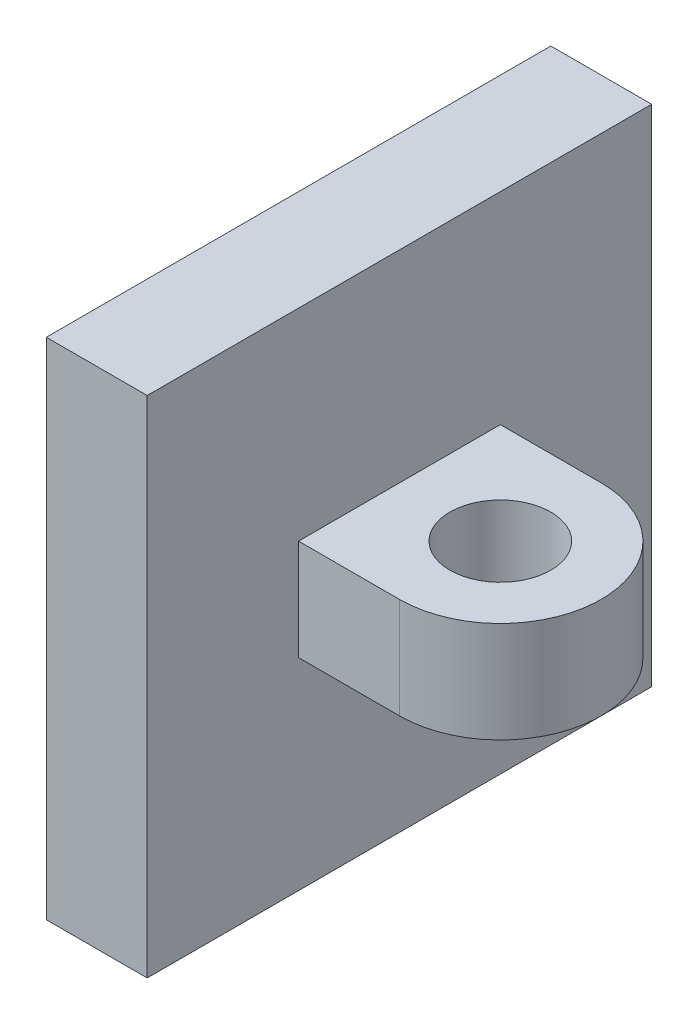
ISO-10303-21;
HEADER;
FILE_DESCRIPTION(('STEP AP214'),'2;1');
FILE_NAME('part.step','',(''),(''),'','','');
FILE_SCHEMA(('AUTOMOTIVE_DESIGN { 1 0 10303 214 1 1 1 1 }'));
ENDSEC;
DATA;
#1=APPLICATION_CONTEXT('core data for automotive mechanical design processes');
#2=APPLICATION_PROTOCOL_DEFINITION('international standard','automotive_design',2000,#1);
#3=PRODUCT_CONTEXT('',#1,'mechanical');
#4=PRODUCT('Part','Part','',(#3));
#5=PRODUCT_RELATED_PRODUCT_CATEGORY('part','',(#4));
#6=PRODUCT_DEFINITION_FORMATION('','',#4);
#7=PRODUCT_DEFINITION_CONTEXT('part definition',#1,'design');
#8=PRODUCT_DEFINITION('design','',#6,#7);
#9=PRODUCT_DEFINITION_SHAPE('','',#8);
#10=(LENGTH_UNIT() NAMED_UNIT(*) SI_UNIT(.MILLI.,.METRE.));
#11=(NAMED_UNIT(*) PLANE_ANGLE_UNIT() SI_UNIT($,.RADIAN.));
#12=(NAMED_UNIT(*) SI_UNIT($,.STERADIAN.) SOLID_ANGLE_UNIT());
#13=UNCERTAINTY_MEASURE_WITH_UNIT(LENGTH_MEASURE(1.E-05),#10,'distance_accuracy_value','');
#14=(GEOMETRIC_REPRESENTATION_CONTEXT(3) GLOBAL_UNCERTAINTY_ASSIGNED_CONTEXT((#13)) GLOBAL_UNIT_ASSIGNED_CONTEXT((#10,
#11,#12)) REPRESENTATION_CONTEXT('',''));
#15=CARTESIAN_POINT('',(0.,0.,0.));
#16=DIRECTION('',(0.,0.,1.));
#17=DIRECTION('',(1.,0.,0.));
#18=AXIS2_PLACEMENT_3D('',#15,#16,#17);
#19=CARTESIAN_POINT('',(-0.770114942528737,10.,-1.62068965517241));
#20=DIRECTION('',(1.,0.,0.));
#21=DIRECTION('',(0.,0.,-1.));
#22=AXIS2_PLACEMENT_3D('',#19,#20,#21);
#23=PLANE('',#22);
#24=DIRECTION('',(0.,0.,1.));
#25=VECTOR('',#24,1.);
#26=CARTESIAN_POINT('',(-0.770114942528737,0.,-1.62068965517241));
#27=LINE('',#26,#25);
#28=CARTESIAN_POINT('',(-0.770114942528737,0.,-1.62068965517241));
#29=VERTEX_POINT('',#28);
#30=CARTESIAN_POINT('',(-0.770114942528736,0.,8.37931034482759));
#31=VERTEX_POINT('',#30);
#32=EDGE_CURVE('E144',#29,#31,#27,.T.);
#33=ORIENTED_EDGE('',*,*,#32,.T.);
#34=DIRECTION('',(0.,-1.,0.));
#35=VECTOR('',#34,1.);
#36=CARTESIAN_POINT('',(-0.770114942528736,10.,8.37931034482759));
#37=LINE('',#36,#35);
#38=CARTESIAN_POINT('',(-0.770114942528736,10.,8.37931034482759));
#39=VERTEX_POINT('',#38);
#40=EDGE_CURVE('E12',#39,#31,#37,.T.);
#41=ORIENTED_EDGE('',*,*,#40,.F.);
#42=DIRECTION('',(0.,0.,1.));
#43=VECTOR('',#42,1.);
#44=CARTESIAN_POINT('',(-0.770114942528737,10.,-1.62068965517241));
#45=LINE('',#44,#43);
#46=CARTESIAN_POINT('',(-0.770114942528737,10.,-1.62068965517241));
#47=VERTEX_POINT('',#46);
#48=EDGE_CURVE('E145',#47,#39,#45,.T.);
#49=ORIENTED_EDGE('',*,*,#48,.F.);
#50=DIRECTION('',(0.,-1.,0.));
#51=VECTOR('',#50,1.);
#52=CARTESIAN_POINT('',(-0.770114942528737,10.,-1.62068965517241));
#53=LINE('',#52,#51);
#54=EDGE_CURVE('E155',#47,#29,#53,.T.);
#55=ORIENTED_EDGE('',*,*,#54,.T.);
#56=EDGE_LOOP('',(#33,#41,#49,#55));
#57=FACE_BOUND('',#56,.T.);
#58=ADVANCED_FACE('F51',(#57),#23,.F.);
#59=CARTESIAN_POINT('',(-0.770114942528736,10.,8.37931034482759));
#60=DIRECTION('',(0.,0.,-1.));
#61=DIRECTION('',(-1.,0.,0.));
#62=AXIS2_PLACEMENT_3D('',#59,#60,#61);
#63=PLANE('',#62);
#64=DIRECTION('',(1.,0.,0.));
#65=VECTOR('',#64,1.);
#66=CARTESIAN_POINT('',(-0.770114942528736,0.,8.37931034482759));
#67=LINE('',#66,#65);
#68=CARTESIAN_POINT('',(1.22988505747126,0.,8.37931034482759));
#69=VERTEX_POINT('',#68);
#70=EDGE_CURVE('E158',#31,#69,#67,.T.);
#71=ORIENTED_EDGE('',*,*,#70,.T.);
#72=DIRECTION('',(0.,-1.,0.));
#73=VECTOR('',#72,1.);
#74=CARTESIAN_POINT('',(1.22988505747126,10.,8.37931034482759));
#75=LINE('',#74,#73);
#76=CARTESIAN_POINT('',(1.22988505747126,10.,8.37931034482759));
#77=VERTEX_POINT('',#76);
#78=EDGE_CURVE('E59',#77,#69,#75,.T.);
#79=ORIENTED_EDGE('',*,*,#78,.F.);
#80=DIRECTION('',(1.,0.,0.));
#81=VECTOR('',#80,1.);
#82=CARTESIAN_POINT('',(-0.770114942528736,10.,8.37931034482759));
#83=LINE('',#82,#81);
#84=EDGE_CURVE('E148',#39,#77,#83,.T.);
#85=ORIENTED_EDGE('',*,*,#84,.F.);
#86=ORIENTED_EDGE('',*,*,#40,.T.);
#87=EDGE_LOOP('',(#71,#79,#85,#86));
#88=FACE_BOUND('',#87,.T.);
#89=ADVANCED_FACE('F189',(#88),#63,.F.);
#90=CARTESIAN_POINT('',(1.22988505747126,10.,-1.62068965517241));
#91=DIRECTION('',(-1.,0.,0.));
#92=DIRECTION('',(0.,0.,1.));
#93=AXIS2_PLACEMENT_3D('',#90,#91,#92);
#94=PLANE('',#93);
#95=DIRECTION('',(0.,1.,0.));
#96=VECTOR('',#95,1.);
#97=CARTESIAN_POINT('',(1.22988505747126,0.,5.37931034482759));
#98=LINE('',#97,#96);
#99=CARTESIAN_POINT('',(1.22988505747126,4.,5.37931034482759));
#100=VERTEX_POINT('',#99);
#101=CARTESIAN_POINT('',(1.22988505747126,6.,5.37931034482759));
#102=VERTEX_POINT('',#101);
#103=EDGE_CURVE('E297',#100,#102,#98,.T.);
#104=ORIENTED_EDGE('',*,*,#103,.T.);
#105=DIRECTION('',(0.,0.,-1.));
#106=VECTOR('',#105,1.);
#107=CARTESIAN_POINT('',(1.22988505747126,6.,0.));
#108=LINE('',#107,#106);
#109=CARTESIAN_POINT('',(1.22988505747126,6.,1.37931034482759));
#110=VERTEX_POINT('',#109);
#111=EDGE_CURVE('E296',#102,#110,#108,.T.);
#112=ORIENTED_EDGE('',*,*,#111,.T.);
#113=DIRECTION('',(0.,1.,0.));
#114=VECTOR('',#113,1.);
#115=CARTESIAN_POINT('',(1.22988505747126,0.,1.37931034482759));
#116=LINE('',#115,#114);
#117=CARTESIAN_POINT('',(1.22988505747126,4.,1.37931034482759));
#118=VERTEX_POINT('',#117);
#119=EDGE_CURVE('E132',#118,#110,#116,.T.);
#120=ORIENTED_EDGE('',*,*,#119,.F.);
#121=DIRECTION('',(0.,0.,-1.));
#122=VECTOR('',#121,1.);
#123=CARTESIAN_POINT('',(1.22988505747126,4.,0.));
#124=LINE('',#123,#122);
#125=EDGE_CURVE('E138',#100,#118,#124,.T.);
#126=ORIENTED_EDGE('',*,*,#125,.F.);
#127=EDGE_LOOP('',(#104,#112,#120,#126));
#128=FACE_BOUND('',#127,.T.);
#129=DIRECTION('',(0.,0.,-1.));
#130=VECTOR('',#129,1.);
#131=CARTESIAN_POINT('',(1.22988505747126,0.,-1.62068965517241));
#132=LINE('',#131,#130);
#133=CARTESIAN_POINT('',(1.22988505747126,0.,-1.62068965517241));
#134=VERTEX_POINT('',#133);
#135=EDGE_CURVE('E160',#69,#134,#132,.T.);
#136=ORIENTED_EDGE('',*,*,#135,.T.);
#137=DIRECTION('',(0.,-1.,0.));
#138=VECTOR('',#137,1.);
#139=CARTESIAN_POINT('',(1.22988505747126,10.,-1.62068965517241));
#140=LINE('',#139,#138);
#141=CARTESIAN_POINT('',(1.22988505747126,10.,-1.62068965517241));
#142=VERTEX_POINT('',#141);
#143=EDGE_CURVE('E165',#142,#134,#140,.T.);
#144=ORIENTED_EDGE('',*,*,#143,.F.);
#145=DIRECTION('',(0.,0.,-1.));
#146=VECTOR('',#145,1.);
#147=CARTESIAN_POINT('',(1.22988505747126,10.,-1.62068965517241));
#148=LINE('',#147,#146);
#149=EDGE_CURVE('E151',#77,#142,#148,.T.);
#150=ORIENTED_EDGE('',*,*,#149,.F.);
#151=ORIENTED_EDGE('',*,*,#78,.T.);
#152=EDGE_LOOP('',(#136,#144,#150,#151));
#153=FACE_BOUND('',#152,.T.);
#154=ADVANCED_FACE('F173',(#128,#153),#94,.F.);
#155=CARTESIAN_POINT('',(-0.770114942528737,10.,-1.62068965517241));
#156=DIRECTION('',(0.,0.,1.));
#157=DIRECTION('',(1.,0.,0.));
#158=AXIS2_PLACEMENT_3D('',#155,#156,#157);
#159=PLANE('',#158);
#160=DIRECTION('',(-1.,0.,0.));
#161=VECTOR('',#160,1.);
#162=CARTESIAN_POINT('',(-0.770114942528737,0.,-1.62068965517241));
#163=LINE('',#162,#161);
#164=EDGE_CURVE('E149',#134,#29,#163,.T.);
#165=ORIENTED_EDGE('',*,*,#164,.T.);
#166=ORIENTED_EDGE('',*,*,#54,.F.);
#167=DIRECTION('',(-1.,0.,0.));
#168=VECTOR('',#167,1.);
#169=CARTESIAN_POINT('',(-0.770114942528737,10.,-1.62068965517241));
#170=LINE('',#169,#168);
#171=EDGE_CURVE('E153',#142,#47,#170,.T.);
#172=ORIENTED_EDGE('',*,*,#171,.F.);
#173=ORIENTED_EDGE('',*,*,#143,.T.);
#174=EDGE_LOOP('',(#165,#166,#172,#173));
#175=FACE_BOUND('',#174,.T.);
#176=ADVANCED_FACE('F182',(#175),#159,.F.);
#177=CARTESIAN_POINT('',(0.,10.,0.));
#178=DIRECTION('',(0.,1.,0.));
#179=DIRECTION('',(0.,0.,1.));
#180=AXIS2_PLACEMENT_3D('',#177,#178,#179);
#181=PLANE('',#180);
#182=ORIENTED_EDGE('',*,*,#48,.T.);
#183=ORIENTED_EDGE('',*,*,#84,.T.);
#184=ORIENTED_EDGE('',*,*,#149,.T.);
#185=ORIENTED_EDGE('',*,*,#171,.T.);
#186=EDGE_LOOP('',(#182,#183,#184,#185));
#187=FACE_BOUND('',#186,.T.);
#188=ADVANCED_FACE('F188',(#187),#181,.T.);
#189=CARTESIAN_POINT('',(0.,0.,0.));
#190=DIRECTION('',(0.,1.,0.));
#191=DIRECTION('',(0.,0.,1.));
#192=AXIS2_PLACEMENT_3D('',#189,#190,#191);
#193=PLANE('',#192);
#194=ORIENTED_EDGE('',*,*,#32,.F.);
#195=ORIENTED_EDGE('',*,*,#164,.F.);
#196=ORIENTED_EDGE('',*,*,#135,.F.);
#197=ORIENTED_EDGE('',*,*,#70,.F.);
#198=EDGE_LOOP('',(#194,#195,#196,#197));
#199=FACE_BOUND('',#198,.T.);
#200=ADVANCED_FACE('F179',(#199),#193,.F.);
#201=CARTESIAN_POINT('',(6.22988505747126,6.,0.));
#202=DIRECTION('',(0.,1.,0.));
#203=DIRECTION('',(0.,0.,1.));
#204=AXIS2_PLACEMENT_3D('',#201,#202,#203);
#205=PLANE('',#204);
#206=CARTESIAN_POINT('',(3.22988505747126,6.,3.37931034482759));
#207=DIRECTION('',(0.,1.,0.));
#208=DIRECTION('',(0.,0.,1.));
#209=AXIS2_PLACEMENT_3D('',#206,#207,#208);
#210=CIRCLE('',#209,2.);
#211=CARTESIAN_POINT('',(3.22988505747126,6.,1.37931034482758));
#212=VERTEX_POINT('',#211);
#213=CARTESIAN_POINT('',(3.22988505747126,6.,5.37931034482759));
#214=VERTEX_POINT('',#213);
#215=EDGE_CURVE('E118',#212,#214,#210,.F.);
#216=ORIENTED_EDGE('',*,*,#215,.F.);
#217=DIRECTION('',(-1.,0.,0.));
#218=VECTOR('',#217,1.);
#219=CARTESIAN_POINT('',(6.22988505747126,6.,1.37931034482758));
#220=LINE('',#219,#218);
#221=EDGE_CURVE('E127',#212,#110,#220,.T.);
#222=ORIENTED_EDGE('',*,*,#221,.T.);
#223=ORIENTED_EDGE('',*,*,#111,.F.);
#224=DIRECTION('',(-1.,0.,0.));
#225=VECTOR('',#224,1.);
#226=CARTESIAN_POINT('',(6.22988505747126,6.,5.37931034482759));
#227=LINE('',#226,#225);
#228=EDGE_CURVE('E74',#214,#102,#227,.T.);
#229=ORIENTED_EDGE('',*,*,#228,.F.);
#230=EDGE_LOOP('',(#216,#222,#223,#229));
#231=FACE_BOUND('',#230,.T.);
#232=CARTESIAN_POINT('',(3.22988505747126,6.,3.37931034482759));
#233=DIRECTION('',(0.,1.,0.));
#234=DIRECTION('',(0.,0.,1.));
#235=AXIS2_PLACEMENT_3D('',#232,#233,#234);
#236=CIRCLE('',#235,1.);
#237=CARTESIAN_POINT('',(3.22988505747126,6.,4.37931034482759));
#238=VERTEX_POINT('',#237);
#239=EDGE_CURVE('E293',#238,#238,#236,.T.);
#240=ORIENTED_EDGE('',*,*,#239,.F.);
#241=EDGE_LOOP('',(#240));
#242=FACE_BOUND('',#241,.T.);
#243=ADVANCED_FACE('F125',(#231,#242),#205,.T.);
#244=CARTESIAN_POINT('',(6.22988505747126,0.,5.37931034482759));
#245=DIRECTION('',(0.,0.,1.));
#246=DIRECTION('',(1.,0.,0.));
#247=AXIS2_PLACEMENT_3D('',#244,#245,#246);
#248=PLANE('',#247);
#249=DIRECTION('',(0.,1.,0.));
#250=VECTOR('',#249,1.);
#251=CARTESIAN_POINT('',(3.22988505747126,-9.,5.37931034482759));
#252=LINE('',#251,#250);
#253=CARTESIAN_POINT('',(3.22988505747126,4.,5.37931034482759));
#254=VERTEX_POINT('',#253);
#255=EDGE_CURVE('E122',#254,#214,#252,.T.);
#256=ORIENTED_EDGE('',*,*,#255,.T.);
#257=ORIENTED_EDGE('',*,*,#228,.T.);
#258=ORIENTED_EDGE('',*,*,#103,.F.);
#259=DIRECTION('',(-1.,0.,0.));
#260=VECTOR('',#259,1.);
#261=CARTESIAN_POINT('',(6.22988505747126,4.,5.37931034482759));
#262=LINE('',#261,#260);
#263=EDGE_CURVE('E136',#254,#100,#262,.T.);
#264=ORIENTED_EDGE('',*,*,#263,.F.);
#265=EDGE_LOOP('',(#256,#257,#258,#264));
#266=FACE_BOUND('',#265,.T.);
#267=ADVANCED_FACE('F206',(#266),#248,.T.);
#268=CARTESIAN_POINT('',(6.22988505747126,4.,0.));
#269=DIRECTION('',(0.,1.,0.));
#270=DIRECTION('',(0.,0.,1.));
#271=AXIS2_PLACEMENT_3D('',#268,#269,#270);
#272=PLANE('',#271);
#273=CARTESIAN_POINT('',(3.22988505747126,4.,3.37931034482759));
#274=DIRECTION('',(0.,1.,0.));
#275=DIRECTION('',(0.,0.,1.));
#276=AXIS2_PLACEMENT_3D('',#273,#274,#275);
#277=CIRCLE('',#276,1.);
#278=CARTESIAN_POINT('',(3.22988505747126,4.,4.37931034482759));
#279=VERTEX_POINT('',#278);
#280=EDGE_CURVE('E54',#279,#279,#277,.T.);
#281=ORIENTED_EDGE('',*,*,#280,.T.);
#282=EDGE_LOOP('',(#281));
#283=FACE_BOUND('',#282,.T.);
#284=DIRECTION('',(-1.,0.,0.));
#285=VECTOR('',#284,1.);
#286=CARTESIAN_POINT('',(6.22988505747126,4.,1.37931034482758));
#287=LINE('',#286,#285);
#288=CARTESIAN_POINT('',(3.22988505747126,4.,1.37931034482758));
#289=VERTEX_POINT('',#288);
#290=EDGE_CURVE('E134',#289,#118,#287,.T.);
#291=ORIENTED_EDGE('',*,*,#290,.F.);
#292=CARTESIAN_POINT('',(3.22988505747126,4.,3.37931034482759));
#293=DIRECTION('',(0.,1.,0.));
#294=DIRECTION('',(0.,0.,1.));
#295=AXIS2_PLACEMENT_3D('',#292,#293,#294);
#296=CIRCLE('',#295,2.);
#297=EDGE_CURVE('E66',#289,#254,#296,.F.);
#298=ORIENTED_EDGE('',*,*,#297,.T.);
#299=ORIENTED_EDGE('',*,*,#263,.T.);
#300=ORIENTED_EDGE('',*,*,#125,.T.);
#301=EDGE_LOOP('',(#291,#298,#299,#300));
#302=FACE_BOUND('',#301,.T.);
#303=ADVANCED_FACE('F209',(#283,#302),#272,.F.);
#304=CARTESIAN_POINT('',(6.22988505747126,0.,1.37931034482758));
#305=DIRECTION('',(0.,0.,1.));
#306=DIRECTION('',(1.,0.,0.));
#307=AXIS2_PLACEMENT_3D('',#304,#305,#306);
#308=PLANE('',#307);
#309=ORIENTED_EDGE('',*,*,#221,.F.);
#310=DIRECTION('',(0.,1.,0.));
#311=VECTOR('',#310,1.);
#312=CARTESIAN_POINT('',(3.22988505747126,-9.,1.37931034482758));
#313=LINE('',#312,#311);
#314=EDGE_CURVE('E115',#289,#212,#313,.T.);
#315=ORIENTED_EDGE('',*,*,#314,.F.);
#316=ORIENTED_EDGE('',*,*,#290,.T.);
#317=ORIENTED_EDGE('',*,*,#119,.T.);
#318=EDGE_LOOP('',(#309,#315,#316,#317));
#319=FACE_BOUND('',#318,.T.);
#320=ADVANCED_FACE('F130',(#319),#308,.F.);
#321=CARTESIAN_POINT('',(3.22988505747126,-9.,3.37931034482759));
#322=DIRECTION('',(0.,1.,0.));
#323=DIRECTION('',(0.,0.,1.));
#324=AXIS2_PLACEMENT_3D('',#321,#322,#323);
#325=CYLINDRICAL_SURFACE('',#324,2.);
#326=ORIENTED_EDGE('',*,*,#314,.T.);
#327=ORIENTED_EDGE('',*,*,#215,.T.);
#328=ORIENTED_EDGE('',*,*,#255,.F.);
#329=ORIENTED_EDGE('',*,*,#297,.F.);
#330=EDGE_LOOP('',(#326,#327,#328,#329));
#331=FACE_BOUND('',#330,.T.);
#332=ADVANCED_FACE('F117',(#331),#325,.T.);
#333=CARTESIAN_POINT('',(3.22988505747126,-9.,3.37931034482759));
#334=DIRECTION('',(0.,1.,0.));
#335=DIRECTION('',(0.,0.,1.));
#336=AXIS2_PLACEMENT_3D('',#333,#334,#335);
#337=CYLINDRICAL_SURFACE('',#336,1.);
#338=ORIENTED_EDGE('',*,*,#239,.T.);
#339=EDGE_LOOP('',(#338));
#340=FACE_BOUND('',#339,.T.);
#341=ORIENTED_EDGE('',*,*,#280,.F.);
#342=EDGE_LOOP('',(#341));
#343=FACE_BOUND('',#342,.T.);
#344=ADVANCED_FACE('F215',(#340,#343),#337,.F.);
#345=CLOSED_SHELL('',(#58,#89,#154,#176,#188,#200,#243,#267,#303,#320,#332,#344));
#346=MANIFOLD_SOLID_BREP('B2',#345);
#347=ADVANCED_BREP_SHAPE_REPRESENTATION('',(#18,#346),#14);
#348=SHAPE_DEFINITION_REPRESENTATION(#9,#347);
ENDSEC;
END-ISO-10303-21;
